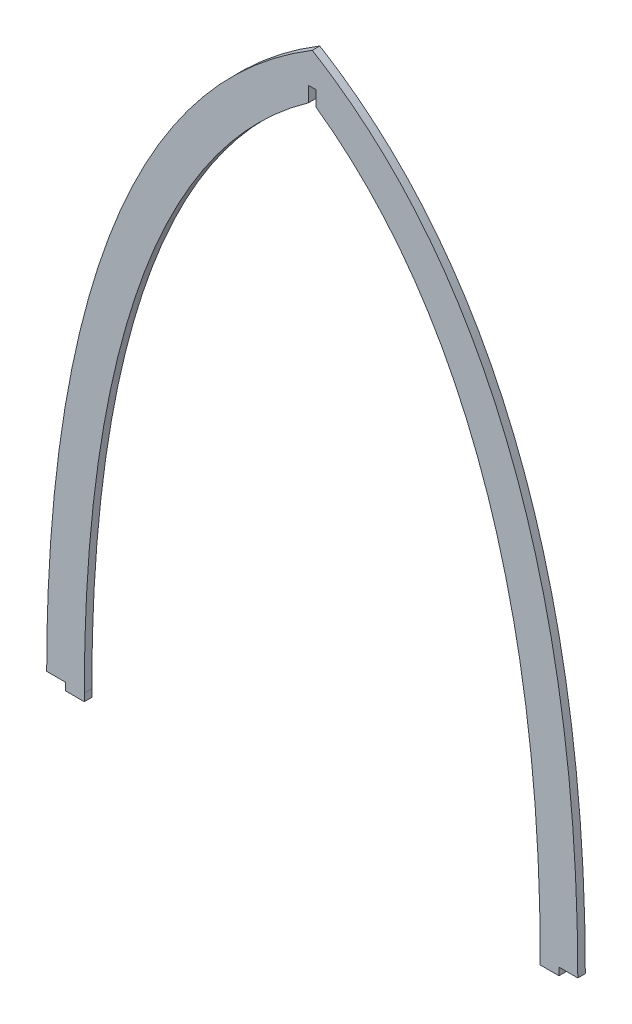
ISO-10303-21;
HEADER;
FILE_DESCRIPTION(('STEP AP214'),'2;1');
FILE_NAME('part.step','',(''),(''),'','','');
FILE_SCHEMA(('AUTOMOTIVE_DESIGN { 1 0 10303 214 1 1 1 1 }'));
ENDSEC;
DATA;
#1=APPLICATION_CONTEXT('core data for automotive mechanical design processes');
#2=APPLICATION_PROTOCOL_DEFINITION('international standard','automotive_design',2000,#1);
#3=PRODUCT_CONTEXT('',#1,'mechanical');
#4=PRODUCT('Part','Part','',(#3));
#5=PRODUCT_RELATED_PRODUCT_CATEGORY('part','',(#4));
#6=PRODUCT_DEFINITION_FORMATION('','',#4);
#7=PRODUCT_DEFINITION_CONTEXT('part definition',#1,'design');
#8=PRODUCT_DEFINITION('design','',#6,#7);
#9=PRODUCT_DEFINITION_SHAPE('','',#8);
#10=(LENGTH_UNIT() NAMED_UNIT(*) SI_UNIT(.MILLI.,.METRE.));
#11=(NAMED_UNIT(*) PLANE_ANGLE_UNIT() SI_UNIT($,.RADIAN.));
#12=(NAMED_UNIT(*) SI_UNIT($,.STERADIAN.) SOLID_ANGLE_UNIT());
#13=UNCERTAINTY_MEASURE_WITH_UNIT(LENGTH_MEASURE(1.E-05),#10,'distance_accuracy_value','');
#14=(GEOMETRIC_REPRESENTATION_CONTEXT(3) GLOBAL_UNCERTAINTY_ASSIGNED_CONTEXT((#13)) GLOBAL_UNIT_ASSIGNED_CONTEXT((#10,
#11,#12)) REPRESENTATION_CONTEXT('',''));
#15=CARTESIAN_POINT('',(0.,0.,0.));
#16=DIRECTION('',(0.,0.,1.));
#17=DIRECTION('',(1.,0.,0.));
#18=AXIS2_PLACEMENT_3D('',#15,#16,#17);
#19=CARTESIAN_POINT('',(105.999999999998,162.000000000004,1.5));
#20=CARTESIAN_POINT('',(105.999999999998,251.511239230205,1.5));
#21=CARTESIAN_POINT('',(88.9480866677907,376.101025723079,1.5));
#22=CARTESIAN_POINT('',(0.,429.683378346812,1.5));
#23=B_SPLINE_CURVE_WITH_KNOTS('',3,(#19,#20,#21,#22),.UNSPECIFIED.,.F.,.F.,(4,4),(0.,1.),.UNSPECIFIED.);
#24=DIRECTION('',(0.,0.,-1.));
#25=VECTOR('',#24,1.);
#26=SURFACE_OF_LINEAR_EXTRUSION('',#23,#25);
#27=CARTESIAN_POINT('',(105.999999999998,162.000000000004,-1.5));
#28=CARTESIAN_POINT('',(105.999999999998,251.511239230205,-1.5));
#29=CARTESIAN_POINT('',(88.9480866677907,376.101025723079,-1.5));
#30=CARTESIAN_POINT('',(0.,429.683378346812,-1.5));
#31=B_SPLINE_CURVE_WITH_KNOTS('',3,(#27,#28,#29,#30),.UNSPECIFIED.,.F.,.F.,(4,4),(0.,1.),.UNSPECIFIED.);
#32=CARTESIAN_POINT('',(105.999999999998,162.000000000004,-1.5));
#33=VERTEX_POINT('',#32);
#34=CARTESIAN_POINT('',(0.,429.683378346812,-1.5));
#35=VERTEX_POINT('',#34);
#36=EDGE_CURVE('E176',#33,#35,#31,.T.);
#37=ORIENTED_EDGE('',*,*,#36,.T.);
#38=DIRECTION('',(0.,0.,-1.));
#39=VECTOR('',#38,1.);
#40=CARTESIAN_POINT('',(0.,429.683378346812,1.5));
#41=LINE('',#40,#39);
#42=CARTESIAN_POINT('',(0.,429.683378346812,1.5));
#43=VERTEX_POINT('',#42);
#44=EDGE_CURVE('E11',#43,#35,#41,.T.);
#45=ORIENTED_EDGE('',*,*,#44,.F.);
#46=CARTESIAN_POINT('',(105.999999999998,162.000000000004,1.5));
#47=VERTEX_POINT('',#46);
#48=EDGE_CURVE('E224',#47,#43,#23,.T.);
#49=ORIENTED_EDGE('',*,*,#48,.F.);
#50=DIRECTION('',(0.,0.,-1.));
#51=VECTOR('',#50,1.);
#52=CARTESIAN_POINT('',(105.999999999998,162.000000000004,1.5));
#53=LINE('',#52,#51);
#54=EDGE_CURVE('E172',#47,#33,#53,.T.);
#55=ORIENTED_EDGE('',*,*,#54,.T.);
#56=EDGE_LOOP('',(#37,#45,#49,#55));
#57=FACE_BOUND('',#56,.T.);
#58=ADVANCED_FACE('F37',(#57),#26,.F.);
#59=CARTESIAN_POINT('',(0.,429.683378346812,1.5));
#60=CARTESIAN_POINT('',(-88.9480866677907,376.101025723079,1.5));
#61=CARTESIAN_POINT('',(-105.999999999998,251.511239230205,1.5));
#62=CARTESIAN_POINT('',(-105.999999999998,162.000000000004,1.5));
#63=B_SPLINE_CURVE_WITH_KNOTS('',3,(#59,#60,#61,#62),.UNSPECIFIED.,.F.,.F.,(4,4),(0.,1.),.UNSPECIFIED.);
#64=DIRECTION('',(0.,0.,-1.));
#65=VECTOR('',#64,1.);
#66=SURFACE_OF_LINEAR_EXTRUSION('',#63,#65);
#67=CARTESIAN_POINT('',(0.,429.683378346812,-1.5));
#68=CARTESIAN_POINT('',(-88.9480866677907,376.101025723079,-1.5));
#69=CARTESIAN_POINT('',(-105.999999999998,251.511239230205,-1.5));
#70=CARTESIAN_POINT('',(-105.999999999998,162.000000000004,-1.5));
#71=B_SPLINE_CURVE_WITH_KNOTS('',3,(#67,#68,#69,#70),.UNSPECIFIED.,.F.,.F.,(4,4),(0.,1.),.UNSPECIFIED.);
#72=CARTESIAN_POINT('',(-105.999999999998,162.000000000004,-1.5));
#73=VERTEX_POINT('',#72);
#74=EDGE_CURVE('E181',#35,#73,#71,.T.);
#75=ORIENTED_EDGE('',*,*,#74,.T.);
#76=DIRECTION('',(0.,0.,-1.));
#77=VECTOR('',#76,1.);
#78=CARTESIAN_POINT('',(-105.999999999998,162.000000000004,1.5));
#79=LINE('',#78,#77);
#80=CARTESIAN_POINT('',(-105.999999999998,162.000000000004,1.5));
#81=VERTEX_POINT('',#80);
#82=EDGE_CURVE('E46',#81,#73,#79,.T.);
#83=ORIENTED_EDGE('',*,*,#82,.F.);
#84=EDGE_CURVE('E118',#43,#81,#63,.T.);
#85=ORIENTED_EDGE('',*,*,#84,.F.);
#86=ORIENTED_EDGE('',*,*,#44,.T.);
#87=EDGE_LOOP('',(#75,#83,#85,#86));
#88=FACE_BOUND('',#87,.T.);
#89=ADVANCED_FACE('F311',(#88),#66,.F.);
#90=CARTESIAN_POINT('',(-105.999999999998,162.000000000004,1.5));
#91=DIRECTION('',(3.77475828372676E-13,1.,0.));
#92=DIRECTION('',(-1.,3.77475828372676E-13,0.));
#93=AXIS2_PLACEMENT_3D('',#90,#91,#92);
#94=PLANE('',#93);
#95=DIRECTION('',(1.,-3.77475828372676E-13,0.));
#96=VECTOR('',#95,1.);
#97=CARTESIAN_POINT('',(-105.999999999998,162.000000000004,-1.5));
#98=LINE('',#97,#96);
#99=CARTESIAN_POINT('',(-98.5000000000003,162.000000000001,-1.5));
#100=VERTEX_POINT('',#99);
#101=EDGE_CURVE('E188',#73,#100,#98,.T.);
#102=ORIENTED_EDGE('',*,*,#101,.T.);
#103=DIRECTION('',(0.,0.,-1.));
#104=VECTOR('',#103,1.);
#105=CARTESIAN_POINT('',(-98.5000000000003,162.000000000001,1.5));
#106=LINE('',#105,#104);
#107=CARTESIAN_POINT('',(-98.5000000000003,162.000000000001,1.5));
#108=VERTEX_POINT('',#107);
#109=EDGE_CURVE('E252',#108,#100,#106,.T.);
#110=ORIENTED_EDGE('',*,*,#109,.F.);
#111=DIRECTION('',(1.,-3.77475828372676E-13,0.));
#112=VECTOR('',#111,1.);
#113=CARTESIAN_POINT('',(-105.999999999998,162.000000000004,1.5));
#114=LINE('',#113,#112);
#115=EDGE_CURVE('E260',#81,#108,#114,.T.);
#116=ORIENTED_EDGE('',*,*,#115,.F.);
#117=ORIENTED_EDGE('',*,*,#82,.T.);
#118=EDGE_LOOP('',(#102,#110,#116,#117));
#119=FACE_BOUND('',#118,.T.);
#120=ADVANCED_FACE('F258',(#119),#94,.F.);
#121=CARTESIAN_POINT('',(-98.5000000000003,159.000000000001,1.5));
#122=DIRECTION('',(1.,0.,0.));
#123=DIRECTION('',(0.,0.,-1.));
#124=AXIS2_PLACEMENT_3D('',#121,#122,#123);
#125=PLANE('',#124);
#126=DIRECTION('',(0.,-1.,0.));
#127=VECTOR('',#126,1.);
#128=CARTESIAN_POINT('',(-98.5000000000003,159.000000000001,-1.5));
#129=LINE('',#128,#127);
#130=CARTESIAN_POINT('',(-98.5000000000003,159.000000000001,-1.5));
#131=VERTEX_POINT('',#130);
#132=EDGE_CURVE('E193',#100,#131,#129,.T.);
#133=ORIENTED_EDGE('',*,*,#132,.T.);
#134=DIRECTION('',(0.,0.,-1.));
#135=VECTOR('',#134,1.);
#136=CARTESIAN_POINT('',(-98.5000000000003,159.000000000001,1.5));
#137=LINE('',#136,#135);
#138=CARTESIAN_POINT('',(-98.5000000000003,159.000000000001,1.5));
#139=VERTEX_POINT('',#138);
#140=EDGE_CURVE('E249',#139,#131,#137,.T.);
#141=ORIENTED_EDGE('',*,*,#140,.F.);
#142=DIRECTION('',(0.,-1.,0.));
#143=VECTOR('',#142,1.);
#144=CARTESIAN_POINT('',(-98.5000000000003,159.000000000001,1.5));
#145=LINE('',#144,#143);
#146=EDGE_CURVE('E278',#108,#139,#145,.T.);
#147=ORIENTED_EDGE('',*,*,#146,.F.);
#148=ORIENTED_EDGE('',*,*,#109,.T.);
#149=EDGE_LOOP('',(#133,#141,#147,#148));
#150=FACE_BOUND('',#149,.T.);
#151=ADVANCED_FACE('F269',(#150),#125,.F.);
#152=CARTESIAN_POINT('',(-91.0000000000003,159.000000000001,1.5));
#153=DIRECTION('',(0.,1.,0.));
#154=DIRECTION('',(0.,0.,1.));
#155=AXIS2_PLACEMENT_3D('',#152,#153,#154);
#156=PLANE('',#155);
#157=DIRECTION('',(1.,0.,0.));
#158=VECTOR('',#157,1.);
#159=CARTESIAN_POINT('',(-91.0000000000003,159.000000000001,-1.5));
#160=LINE('',#159,#158);
#161=CARTESIAN_POINT('',(-91.0000000000003,159.000000000001,-1.5));
#162=VERTEX_POINT('',#161);
#163=EDGE_CURVE('E195',#131,#162,#160,.T.);
#164=ORIENTED_EDGE('',*,*,#163,.T.);
#165=DIRECTION('',(0.,0.,-1.));
#166=VECTOR('',#165,1.);
#167=CARTESIAN_POINT('',(-91.0000000000003,159.000000000001,1.5));
#168=LINE('',#167,#166);
#169=CARTESIAN_POINT('',(-91.0000000000003,159.000000000001,1.5));
#170=VERTEX_POINT('',#169);
#171=EDGE_CURVE('E246',#170,#162,#168,.T.);
#172=ORIENTED_EDGE('',*,*,#171,.F.);
#173=DIRECTION('',(1.,0.,0.));
#174=VECTOR('',#173,1.);
#175=CARTESIAN_POINT('',(-91.0000000000003,159.000000000001,1.5));
#176=LINE('',#175,#174);
#177=EDGE_CURVE('E275',#139,#170,#176,.T.);
#178=ORIENTED_EDGE('',*,*,#177,.F.);
#179=ORIENTED_EDGE('',*,*,#140,.T.);
#180=EDGE_LOOP('',(#164,#172,#178,#179));
#181=FACE_BOUND('',#180,.T.);
#182=ADVANCED_FACE('F273',(#181),#156,.F.);
#183=CARTESIAN_POINT('',(-90.9999999999979,162.000000000004,1.5));
#184=DIRECTION('',(-1.,8.0953762212173E-13,0.));
#185=DIRECTION('',(-8.0953762212173E-13,-1.,0.));
#186=AXIS2_PLACEMENT_3D('',#183,#184,#185);
#187=PLANE('',#186);
#188=DIRECTION('',(8.0953762212173E-13,1.,0.));
#189=VECTOR('',#188,1.);
#190=CARTESIAN_POINT('',(-90.9999999999979,162.000000000004,-1.5));
#191=LINE('',#190,#189);
#192=CARTESIAN_POINT('',(-90.9999999999979,162.000000000004,-1.5));
#193=VERTEX_POINT('',#192);
#194=EDGE_CURVE('E197',#162,#193,#191,.T.);
#195=ORIENTED_EDGE('',*,*,#194,.T.);
#196=DIRECTION('',(0.,0.,-1.));
#197=VECTOR('',#196,1.);
#198=CARTESIAN_POINT('',(-90.9999999999979,162.000000000004,1.5));
#199=LINE('',#198,#197);
#200=CARTESIAN_POINT('',(-90.9999999999979,162.000000000004,1.5));
#201=VERTEX_POINT('',#200);
#202=EDGE_CURVE('E243',#201,#193,#199,.T.);
#203=ORIENTED_EDGE('',*,*,#202,.F.);
#204=DIRECTION('',(8.0953762212173E-13,1.,0.));
#205=VECTOR('',#204,1.);
#206=CARTESIAN_POINT('',(-90.9999999999979,162.000000000004,1.5));
#207=LINE('',#206,#205);
#208=EDGE_CURVE('E277',#170,#201,#207,.T.);
#209=ORIENTED_EDGE('',*,*,#208,.F.);
#210=ORIENTED_EDGE('',*,*,#171,.T.);
#211=EDGE_LOOP('',(#195,#203,#209,#210));
#212=FACE_BOUND('',#211,.T.);
#213=ADVANCED_FACE('F300',(#212),#187,.F.);
#214=CARTESIAN_POINT('',(-90.9999999999979,162.000000000004,1.5));
#215=CARTESIAN_POINT('',(-91.0000003023244,163.331524351603,1.5));
#216=CARTESIAN_POINT('',(-90.9923772208511,165.983871564798,1.5));
#217=CARTESIAN_POINT('',(-90.9451731433241,171.374042760837,1.5));
#218=CARTESIAN_POINT('',(-90.8235078746332,178.205931855945,1.5));
#219=CARTESIAN_POINT('',(-90.5685215486452,186.555762495825,1.5));
#220=CARTESIAN_POINT('',(-90.0716530330046,197.860050944264,1.5));
#221=CARTESIAN_POINT('',(-89.1348004093346,212.269083652878,1.5));
#222=CARTESIAN_POINT('',(-87.4371070231186,229.8590328661,1.5));
#223=CARTESIAN_POINT('',(-85.0989947623211,247.601920352728,1.5));
#224=CARTESIAN_POINT('',(-81.0408896792529,271.267133734514,1.5));
#225=CARTESIAN_POINT('',(-74.0454955742705,300.495573647248,1.5));
#226=CARTESIAN_POINT('',(-62.1021844250291,333.833321675898,1.5));
#227=CARTESIAN_POINT('',(-48.8481628022896,359.221880846358,1.5));
#228=CARTESIAN_POINT('',(-36.0733572473476,377.590498753788,1.5));
#229=CARTESIAN_POINT('',(-25.355736840022,390.287263764066,1.5));
#230=CARTESIAN_POINT('',(-15.4180683562845,399.891345578018,1.5));
#231=CARTESIAN_POINT('',(-6.83792647578161,406.934515176343,1.5));
#232=CARTESIAN_POINT('',(-2.30437264100325,410.252851189701,1.5));
#233=CARTESIAN_POINT('',(-4.23001881166236E-05,411.841712632891,1.5));
#234=B_SPLINE_CURVE_WITH_KNOTS('',3,(#214,#215,#216,#217,#218,#219,#220,#221,#222,#223,#224,
#225,#226,#227,#228,#229,#230,#231,#232,#233),.UNSPECIFIED.,.F.,.F.,(4,1,1,1,1,1,1,1,1,1,1,1,1,
1,1,1,1,4),(0.,0.0151129692576097,0.0302259385152194,0.0604518770304388,0.0906778155456583,
0.120903754060878,0.181355631091317,0.241807508121755,0.302259385152194,0.362711262182633,
0.483615016243511,0.604518770304388,0.725422524365266,0.785874401395705,0.846326278426144,
0.906778155456583,0.937004093971802,0.967230032487022),.UNSPECIFIED.);
#235=DIRECTION('',(0.,0.,-1.));
#236=VECTOR('',#235,1.);
#237=SURFACE_OF_LINEAR_EXTRUSION('',#234,#236);
#238=CARTESIAN_POINT('',(-90.9999999999979,162.000000000004,-1.5));
#239=CARTESIAN_POINT('',(-91.0000003023244,163.331524351603,-1.5));
#240=CARTESIAN_POINT('',(-90.9923772208511,165.983871564798,-1.5));
#241=CARTESIAN_POINT('',(-90.9451731433241,171.374042760837,-1.5));
#242=CARTESIAN_POINT('',(-90.8235078746332,178.205931855945,-1.5));
#243=CARTESIAN_POINT('',(-90.5685215486452,186.555762495825,-1.5));
#244=CARTESIAN_POINT('',(-90.0716530330046,197.860050944264,-1.5));
#245=CARTESIAN_POINT('',(-89.1348004093346,212.269083652878,-1.5));
#246=CARTESIAN_POINT('',(-87.4371070231186,229.8590328661,-1.5));
#247=CARTESIAN_POINT('',(-85.0989947623211,247.601920352728,-1.5));
#248=CARTESIAN_POINT('',(-81.0408896792529,271.267133734514,-1.5));
#249=CARTESIAN_POINT('',(-74.0454955742705,300.495573647248,-1.5));
#250=CARTESIAN_POINT('',(-62.1021844250291,333.833321675898,-1.5));
#251=CARTESIAN_POINT('',(-48.8481628022896,359.221880846358,-1.5));
#252=CARTESIAN_POINT('',(-36.0733572473476,377.590498753788,-1.5));
#253=CARTESIAN_POINT('',(-25.355736840022,390.287263764066,-1.5));
#254=CARTESIAN_POINT('',(-15.4180683562845,399.891345578018,-1.5));
#255=CARTESIAN_POINT('',(-6.83792647578161,406.934515176343,-1.5));
#256=CARTESIAN_POINT('',(-2.30437264100325,410.252851189701,-1.5));
#257=CARTESIAN_POINT('',(-4.23001881166236E-05,411.841712632891,-1.5));
#258=B_SPLINE_CURVE_WITH_KNOTS('',3,(#238,#239,#240,#241,#242,#243,#244,#245,#246,#247,#248,
#249,#250,#251,#252,#253,#254,#255,#256,#257),.UNSPECIFIED.,.F.,.F.,(4,1,1,1,1,1,1,1,1,1,1,1,1,
1,1,1,1,4),(0.,0.0151129692576097,0.0302259385152194,0.0604518770304388,0.0906778155456583,
0.120903754060878,0.181355631091317,0.241807508121755,0.302259385152194,0.362711262182633,
0.483615016243511,0.604518770304388,0.725422524365266,0.785874401395705,0.846326278426144,
0.906778155456583,0.937004093971802,0.967230032487022),.UNSPECIFIED.);
#259=CARTESIAN_POINT('',(-1.50000000000011,410.793822053137,-1.5));
#260=VERTEX_POINT('',#259);
#261=EDGE_CURVE('E199',#193,#260,#258,.T.);
#262=ORIENTED_EDGE('',*,*,#261,.T.);
#263=DIRECTION('',(0.,0.,-1.));
#264=VECTOR('',#263,1.);
#265=CARTESIAN_POINT('',(-1.50000000000011,410.793822053137,1.5));
#266=LINE('',#265,#264);
#267=CARTESIAN_POINT('',(-1.50000000000011,410.793822053137,1.5));
#268=VERTEX_POINT('',#267);
#269=EDGE_CURVE('E240',#268,#260,#266,.T.);
#270=ORIENTED_EDGE('',*,*,#269,.F.);
#271=EDGE_CURVE('E280',#201,#268,#234,.T.);
#272=ORIENTED_EDGE('',*,*,#271,.F.);
#273=ORIENTED_EDGE('',*,*,#202,.T.);
#274=EDGE_LOOP('',(#262,#270,#272,#273));
#275=FACE_BOUND('',#274,.T.);
#276=ADVANCED_FACE('F295',(#275),#237,.F.);
#277=CARTESIAN_POINT('',(-1.50000000000011,410.793822053137,1.5));
#278=DIRECTION('',(-1.,0.,0.));
#279=DIRECTION('',(0.,-1.,0.));
#280=AXIS2_PLACEMENT_3D('',#277,#278,#279);
#281=PLANE('',#280);
#282=DIRECTION('',(0.,1.,0.));
#283=VECTOR('',#282,1.);
#284=CARTESIAN_POINT('',(-1.50000000000011,410.793822053137,-1.5));
#285=LINE('',#284,#283);
#286=CARTESIAN_POINT('',(-1.50000000000013,416.841652361276,-1.5));
#287=VERTEX_POINT('',#286);
#288=EDGE_CURVE('E203',#260,#287,#285,.T.);
#289=ORIENTED_EDGE('',*,*,#288,.T.);
#290=DIRECTION('',(0.,0.,-1.));
#291=VECTOR('',#290,1.);
#292=CARTESIAN_POINT('',(-1.50000000000013,416.841652361276,1.5));
#293=LINE('',#292,#291);
#294=CARTESIAN_POINT('',(-1.50000000000013,416.841652361276,1.5));
#295=VERTEX_POINT('',#294);
#296=EDGE_CURVE('E237',#295,#287,#293,.T.);
#297=ORIENTED_EDGE('',*,*,#296,.F.);
#298=DIRECTION('',(0.,1.,0.));
#299=VECTOR('',#298,1.);
#300=CARTESIAN_POINT('',(-1.50000000000011,410.793822053137,1.5));
#301=LINE('',#300,#299);
#302=EDGE_CURVE('E289',#268,#295,#301,.T.);
#303=ORIENTED_EDGE('',*,*,#302,.F.);
#304=ORIENTED_EDGE('',*,*,#269,.T.);
#305=EDGE_LOOP('',(#289,#297,#303,#304));
#306=FACE_BOUND('',#305,.T.);
#307=ADVANCED_FACE('F299',(#306),#281,.F.);
#308=CARTESIAN_POINT('',(-1.50000000000013,416.841652361276,1.5));
#309=DIRECTION('',(0.,1.,0.));
#310=DIRECTION('',(-1.,0.,0.));
#311=AXIS2_PLACEMENT_3D('',#308,#309,#310);
#312=PLANE('',#311);
#313=DIRECTION('',(1.,0.,0.));
#314=VECTOR('',#313,1.);
#315=CARTESIAN_POINT('',(-1.50000000000013,416.841652361276,-1.5));
#316=LINE('',#315,#314);
#317=CARTESIAN_POINT('',(1.49999999999987,416.841652361276,-1.5));
#318=VERTEX_POINT('',#317);
#319=EDGE_CURVE('E208',#287,#318,#316,.T.);
#320=ORIENTED_EDGE('',*,*,#319,.T.);
#321=DIRECTION('',(0.,0.,-1.));
#322=VECTOR('',#321,1.);
#323=CARTESIAN_POINT('',(1.49999999999987,416.841652361276,1.5));
#324=LINE('',#323,#322);
#325=CARTESIAN_POINT('',(1.49999999999987,416.841652361276,1.5));
#326=VERTEX_POINT('',#325);
#327=EDGE_CURVE('E234',#326,#318,#324,.T.);
#328=ORIENTED_EDGE('',*,*,#327,.F.);
#329=DIRECTION('',(1.,0.,0.));
#330=VECTOR('',#329,1.);
#331=CARTESIAN_POINT('',(-1.50000000000013,416.841652361276,1.5));
#332=LINE('',#331,#330);
#333=EDGE_CURVE('E349',#295,#326,#332,.T.);
#334=ORIENTED_EDGE('',*,*,#333,.F.);
#335=ORIENTED_EDGE('',*,*,#296,.T.);
#336=EDGE_LOOP('',(#320,#328,#334,#335));
#337=FACE_BOUND('',#336,.T.);
#338=ADVANCED_FACE('F346',(#337),#312,.F.);
#339=CARTESIAN_POINT('',(1.49999999999987,416.841652361276,1.5));
#340=DIRECTION('',(1.,-1.59909965819582E-13,0.));
#341=DIRECTION('',(1.59909965819582E-13,1.,0.));
#342=AXIS2_PLACEMENT_3D('',#339,#340,#341);
#343=PLANE('',#342);
#344=DIRECTION('',(-1.59909965819582E-13,-1.,0.));
#345=VECTOR('',#344,1.);
#346=CARTESIAN_POINT('',(1.49999999999987,416.841652361276,-1.5));
#347=LINE('',#346,#345);
#348=CARTESIAN_POINT('',(1.49999999999895,410.793822053138,-1.5));
#349=VERTEX_POINT('',#348);
#350=EDGE_CURVE('E210',#318,#349,#347,.T.);
#351=ORIENTED_EDGE('',*,*,#350,.T.);
#352=DIRECTION('',(0.,0.,-1.));
#353=VECTOR('',#352,1.);
#354=CARTESIAN_POINT('',(1.49999999999895,410.793822053138,1.5));
#355=LINE('',#354,#353);
#356=CARTESIAN_POINT('',(1.49999999999895,410.793822053138,1.5));
#357=VERTEX_POINT('',#356);
#358=EDGE_CURVE('E231',#357,#349,#355,.T.);
#359=ORIENTED_EDGE('',*,*,#358,.F.);
#360=DIRECTION('',(-1.59909965819582E-13,-1.,0.));
#361=VECTOR('',#360,1.);
#362=CARTESIAN_POINT('',(1.49999999999987,416.841652361276,1.5));
#363=LINE('',#362,#361);
#364=EDGE_CURVE('E340',#326,#357,#363,.T.);
#365=ORIENTED_EDGE('',*,*,#364,.F.);
#366=ORIENTED_EDGE('',*,*,#327,.T.);
#367=EDGE_LOOP('',(#351,#359,#365,#366));
#368=FACE_BOUND('',#367,.T.);
#369=ADVANCED_FACE('F339',(#368),#343,.F.);
#370=CARTESIAN_POINT('',(4.23002207411026E-05,411.841712632868,1.5));
#371=CARTESIAN_POINT('',(2.30437264103542,410.252851189678,1.5));
#372=CARTESIAN_POINT('',(6.83792647581292,406.93451517632,1.5));
#373=CARTESIAN_POINT('',(15.4180683563142,399.891345577995,1.5));
#374=CARTESIAN_POINT('',(25.3557368400496,390.287263764044,1.5));
#375=CARTESIAN_POINT('',(36.0733572473729,377.590498753766,1.5));
#376=CARTESIAN_POINT('',(48.8481628023117,359.221880846338,1.5));
#377=CARTESIAN_POINT('',(62.1021844250474,333.833321675879,1.5));
#378=CARTESIAN_POINT('',(74.0454955742846,300.495573647233,1.5));
#379=CARTESIAN_POINT('',(81.0408896792635,271.267133734502,1.5));
#380=CARTESIAN_POINT('',(85.0989947623292,247.601920352719,1.5));
#381=CARTESIAN_POINT('',(87.4371070231248,229.859032866092,1.5));
#382=CARTESIAN_POINT('',(89.1348004093392,212.269083652873,1.5));
#383=CARTESIAN_POINT('',(90.0716530330079,197.86005094426,1.5));
#384=CARTESIAN_POINT('',(90.5685215486474,186.555762495822,1.5));
#385=CARTESIAN_POINT('',(90.8235078746347,178.205931855944,1.5));
#386=CARTESIAN_POINT('',(90.9451731433249,171.374042760836,1.5));
#387=CARTESIAN_POINT('',(90.9923772208515,165.983871564798,1.5));
#388=CARTESIAN_POINT('',(91.0000003023246,163.331524351603,1.5));
#389=CARTESIAN_POINT('',(90.999999999998,162.000000000004,1.5));
#390=B_SPLINE_CURVE_WITH_KNOTS('',3,(#370,#371,#372,#373,#374,#375,#376,#377,#378,#379,#380,
#381,#382,#383,#384,#385,#386,#387,#388,#389),.UNSPECIFIED.,.F.,.F.,(4,1,1,1,1,1,1,1,1,1,1,1,1,
1,1,1,1,4),(0.,0.0302259385152195,0.0604518770304389,0.120903754060878,0.181355631091316,
0.241807508121755,0.362711262182633,0.483615016243511,0.604518770304388,0.664970647334827,
0.725422524365266,0.785874401395705,0.846326278426144,0.876552216941363,0.906778155456582,
0.937004093971802,0.952117063229412,0.967230032487021),.UNSPECIFIED.);
#391=DIRECTION('',(0.,0.,-1.));
#392=VECTOR('',#391,1.);
#393=SURFACE_OF_LINEAR_EXTRUSION('',#390,#392);
#394=CARTESIAN_POINT('',(4.23002207411026E-05,411.841712632868,-1.5));
#395=CARTESIAN_POINT('',(2.30437264103542,410.252851189678,-1.5));
#396=CARTESIAN_POINT('',(6.83792647581292,406.93451517632,-1.5));
#397=CARTESIAN_POINT('',(15.4180683563142,399.891345577995,-1.5));
#398=CARTESIAN_POINT('',(25.3557368400496,390.287263764044,-1.5));
#399=CARTESIAN_POINT('',(36.0733572473729,377.590498753766,-1.5));
#400=CARTESIAN_POINT('',(48.8481628023117,359.221880846338,-1.5));
#401=CARTESIAN_POINT('',(62.1021844250474,333.833321675879,-1.5));
#402=CARTESIAN_POINT('',(74.0454955742846,300.495573647233,-1.5));
#403=CARTESIAN_POINT('',(81.0408896792635,271.267133734502,-1.5));
#404=CARTESIAN_POINT('',(85.0989947623292,247.601920352719,-1.5));
#405=CARTESIAN_POINT('',(87.4371070231248,229.859032866092,-1.5));
#406=CARTESIAN_POINT('',(89.1348004093392,212.269083652873,-1.5));
#407=CARTESIAN_POINT('',(90.0716530330079,197.86005094426,-1.5));
#408=CARTESIAN_POINT('',(90.5685215486474,186.555762495822,-1.5));
#409=CARTESIAN_POINT('',(90.8235078746347,178.205931855944,-1.5));
#410=CARTESIAN_POINT('',(90.9451731433249,171.374042760836,-1.5));
#411=CARTESIAN_POINT('',(90.9923772208515,165.983871564798,-1.5));
#412=CARTESIAN_POINT('',(91.0000003023246,163.331524351603,-1.5));
#413=CARTESIAN_POINT('',(90.999999999998,162.000000000004,-1.5));
#414=B_SPLINE_CURVE_WITH_KNOTS('',3,(#394,#395,#396,#397,#398,#399,#400,#401,#402,#403,#404,
#405,#406,#407,#408,#409,#410,#411,#412,#413),.UNSPECIFIED.,.F.,.F.,(4,1,1,1,1,1,1,1,1,1,1,1,1,
1,1,1,1,4),(0.,0.0302259385152195,0.0604518770304389,0.120903754060878,0.181355631091316,
0.241807508121755,0.362711262182633,0.483615016243511,0.604518770304388,0.664970647334827,
0.725422524365266,0.785874401395705,0.846326278426144,0.876552216941363,0.906778155456582,
0.937004093971802,0.952117063229412,0.967230032487021),.UNSPECIFIED.);
#415=CARTESIAN_POINT('',(90.9999999999979,162.000000000004,-1.5));
#416=VERTEX_POINT('',#415);
#417=EDGE_CURVE('E212',#349,#416,#414,.T.);
#418=ORIENTED_EDGE('',*,*,#417,.T.);
#419=DIRECTION('',(0.,0.,-1.));
#420=VECTOR('',#419,1.);
#421=CARTESIAN_POINT('',(90.9999999999979,162.000000000004,1.5));
#422=LINE('',#421,#420);
#423=CARTESIAN_POINT('',(90.9999999999979,162.000000000004,1.5));
#424=VERTEX_POINT('',#423);
#425=EDGE_CURVE('E228',#424,#416,#422,.T.);
#426=ORIENTED_EDGE('',*,*,#425,.F.);
#427=EDGE_CURVE('E335',#357,#424,#390,.T.);
#428=ORIENTED_EDGE('',*,*,#427,.F.);
#429=ORIENTED_EDGE('',*,*,#358,.T.);
#430=EDGE_LOOP('',(#418,#426,#428,#429));
#431=FACE_BOUND('',#430,.T.);
#432=ADVANCED_FACE('F334',(#431),#393,.F.);
#433=CARTESIAN_POINT('',(90.9999999999979,162.000000000004,1.5));
#434=DIRECTION('',(1.,8.09537622121723E-13,0.));
#435=DIRECTION('',(-8.09537622121723E-13,1.,0.));
#436=AXIS2_PLACEMENT_3D('',#433,#434,#435);
#437=PLANE('',#436);
#438=DIRECTION('',(8.09537622121723E-13,-1.,0.));
#439=VECTOR('',#438,1.);
#440=CARTESIAN_POINT('',(90.9999999999979,162.000000000004,-1.5));
#441=LINE('',#440,#439);
#442=CARTESIAN_POINT('',(91.0000000000004,159.000000000001,-1.5));
#443=VERTEX_POINT('',#442);
#444=EDGE_CURVE('E216',#416,#443,#441,.T.);
#445=ORIENTED_EDGE('',*,*,#444,.T.);
#446=DIRECTION('',(0.,0.,-1.));
#447=VECTOR('',#446,1.);
#448=CARTESIAN_POINT('',(91.0000000000004,159.000000000001,1.5));
#449=LINE('',#448,#447);
#450=CARTESIAN_POINT('',(91.0000000000004,159.000000000001,1.5));
#451=VERTEX_POINT('',#450);
#452=EDGE_CURVE('E167',#451,#443,#449,.T.);
#453=ORIENTED_EDGE('',*,*,#452,.F.);
#454=DIRECTION('',(8.09537622121723E-13,-1.,0.));
#455=VECTOR('',#454,1.);
#456=CARTESIAN_POINT('',(90.9999999999979,162.000000000004,1.5));
#457=LINE('',#456,#455);
#458=EDGE_CURVE('E158',#424,#451,#457,.T.);
#459=ORIENTED_EDGE('',*,*,#458,.F.);
#460=ORIENTED_EDGE('',*,*,#425,.T.);
#461=EDGE_LOOP('',(#445,#453,#459,#460));
#462=FACE_BOUND('',#461,.T.);
#463=ADVANCED_FACE('F330',(#462),#437,.F.);
#464=CARTESIAN_POINT('',(91.0000000000004,159.000000000001,1.5));
#465=DIRECTION('',(0.,1.,0.));
#466=DIRECTION('',(0.,0.,1.));
#467=AXIS2_PLACEMENT_3D('',#464,#465,#466);
#468=PLANE('',#467);
#469=DIRECTION('',(1.,0.,0.));
#470=VECTOR('',#469,1.);
#471=CARTESIAN_POINT('',(91.0000000000004,159.000000000001,-1.5));
#472=LINE('',#471,#470);
#473=CARTESIAN_POINT('',(98.5000000000004,159.000000000001,-1.5));
#474=VERTEX_POINT('',#473);
#475=EDGE_CURVE('E166',#443,#474,#472,.T.);
#476=ORIENTED_EDGE('',*,*,#475,.T.);
#477=DIRECTION('',(0.,0.,-1.));
#478=VECTOR('',#477,1.);
#479=CARTESIAN_POINT('',(98.5000000000004,159.000000000001,1.5));
#480=LINE('',#479,#478);
#481=CARTESIAN_POINT('',(98.5000000000004,159.000000000001,1.5));
#482=VERTEX_POINT('',#481);
#483=EDGE_CURVE('E163',#482,#474,#480,.T.);
#484=ORIENTED_EDGE('',*,*,#483,.F.);
#485=DIRECTION('',(1.,0.,0.));
#486=VECTOR('',#485,1.);
#487=CARTESIAN_POINT('',(91.0000000000004,159.000000000001,1.5));
#488=LINE('',#487,#486);
#489=EDGE_CURVE('E152',#451,#482,#488,.T.);
#490=ORIENTED_EDGE('',*,*,#489,.F.);
#491=ORIENTED_EDGE('',*,*,#452,.T.);
#492=EDGE_LOOP('',(#476,#484,#490,#491));
#493=FACE_BOUND('',#492,.T.);
#494=ADVANCED_FACE('F164',(#493),#468,.F.);
#495=CARTESIAN_POINT('',(98.5000000000004,159.000000000001,1.5));
#496=DIRECTION('',(-1.,0.,0.));
#497=DIRECTION('',(0.,0.,1.));
#498=AXIS2_PLACEMENT_3D('',#495,#496,#497);
#499=PLANE('',#498);
#500=DIRECTION('',(0.,1.,0.));
#501=VECTOR('',#500,1.);
#502=CARTESIAN_POINT('',(98.5000000000004,159.000000000001,-1.5));
#503=LINE('',#502,#501);
#504=CARTESIAN_POINT('',(98.5000000000004,162.000000000001,-1.5));
#505=VERTEX_POINT('',#504);
#506=EDGE_CURVE('E104',#474,#505,#503,.T.);
#507=ORIENTED_EDGE('',*,*,#506,.T.);
#508=DIRECTION('',(0.,0.,-1.));
#509=VECTOR('',#508,1.);
#510=CARTESIAN_POINT('',(98.5000000000004,162.000000000001,1.5));
#511=LINE('',#510,#509);
#512=CARTESIAN_POINT('',(98.5000000000004,162.000000000001,1.5));
#513=VERTEX_POINT('',#512);
#514=EDGE_CURVE('E168',#513,#505,#511,.T.);
#515=ORIENTED_EDGE('',*,*,#514,.F.);
#516=DIRECTION('',(0.,1.,0.));
#517=VECTOR('',#516,1.);
#518=CARTESIAN_POINT('',(98.5000000000004,159.000000000001,1.5));
#519=LINE('',#518,#517);
#520=EDGE_CURVE('E156',#482,#513,#519,.T.);
#521=ORIENTED_EDGE('',*,*,#520,.F.);
#522=ORIENTED_EDGE('',*,*,#483,.T.);
#523=EDGE_LOOP('',(#507,#515,#521,#522));
#524=FACE_BOUND('',#523,.T.);
#525=ADVANCED_FACE('F170',(#524),#499,.F.);
#526=CARTESIAN_POINT('',(98.5000000000004,162.000000000001,1.5));
#527=DIRECTION('',(-3.77475828372676E-13,1.,0.));
#528=DIRECTION('',(-1.,-3.77475828372676E-13,0.));
#529=AXIS2_PLACEMENT_3D('',#526,#527,#528);
#530=PLANE('',#529);
#531=DIRECTION('',(1.,3.77475828372676E-13,0.));
#532=VECTOR('',#531,1.);
#533=CARTESIAN_POINT('',(98.5000000000004,162.000000000001,-1.5));
#534=LINE('',#533,#532);
#535=EDGE_CURVE('E110',#505,#33,#534,.T.);
#536=ORIENTED_EDGE('',*,*,#535,.T.);
#537=ORIENTED_EDGE('',*,*,#54,.F.);
#538=DIRECTION('',(1.,3.77475828372676E-13,0.));
#539=VECTOR('',#538,1.);
#540=CARTESIAN_POINT('',(98.5000000000004,162.000000000001,1.5));
#541=LINE('',#540,#539);
#542=EDGE_CURVE('E54',#513,#47,#541,.T.);
#543=ORIENTED_EDGE('',*,*,#542,.F.);
#544=ORIENTED_EDGE('',*,*,#514,.T.);
#545=EDGE_LOOP('',(#536,#537,#543,#544));
#546=FACE_BOUND('',#545,.T.);
#547=ADVANCED_FACE('F444',(#546),#530,.F.);
#548=CARTESIAN_POINT('',(86.3555325004205,309.315021650833,1.5));
#549=DIRECTION('',(0.,0.,-1.));
#550=DIRECTION('',(-1.,0.,0.));
#551=AXIS2_PLACEMENT_3D('',#548,#549,#550);
#552=PLANE('',#551);
#553=ORIENTED_EDGE('',*,*,#48,.T.);
#554=ORIENTED_EDGE('',*,*,#84,.T.);
#555=ORIENTED_EDGE('',*,*,#115,.T.);
#556=ORIENTED_EDGE('',*,*,#146,.T.);
#557=ORIENTED_EDGE('',*,*,#177,.T.);
#558=ORIENTED_EDGE('',*,*,#208,.T.);
#559=ORIENTED_EDGE('',*,*,#271,.T.);
#560=ORIENTED_EDGE('',*,*,#302,.T.);
#561=ORIENTED_EDGE('',*,*,#333,.T.);
#562=ORIENTED_EDGE('',*,*,#364,.T.);
#563=ORIENTED_EDGE('',*,*,#427,.T.);
#564=ORIENTED_EDGE('',*,*,#458,.T.);
#565=ORIENTED_EDGE('',*,*,#489,.T.);
#566=ORIENTED_EDGE('',*,*,#520,.T.);
#567=ORIENTED_EDGE('',*,*,#542,.T.);
#568=EDGE_LOOP('',(#553,#554,#555,#556,#557,#558,#559,#560,#561,#562,#563,#564,#565,#566,#567));
#569=FACE_BOUND('',#568,.T.);
#570=ADVANCED_FACE('F154',(#569),#552,.F.);
#571=CARTESIAN_POINT('',(86.3555325004205,309.315021650833,-1.5));
#572=DIRECTION('',(0.,0.,-1.));
#573=DIRECTION('',(-1.,0.,0.));
#574=AXIS2_PLACEMENT_3D('',#571,#572,#573);
#575=PLANE('',#574);
#576=ORIENTED_EDGE('',*,*,#36,.F.);
#577=ORIENTED_EDGE('',*,*,#535,.F.);
#578=ORIENTED_EDGE('',*,*,#506,.F.);
#579=ORIENTED_EDGE('',*,*,#475,.F.);
#580=ORIENTED_EDGE('',*,*,#444,.F.);
#581=ORIENTED_EDGE('',*,*,#417,.F.);
#582=ORIENTED_EDGE('',*,*,#350,.F.);
#583=ORIENTED_EDGE('',*,*,#319,.F.);
#584=ORIENTED_EDGE('',*,*,#288,.F.);
#585=ORIENTED_EDGE('',*,*,#261,.F.);
#586=ORIENTED_EDGE('',*,*,#194,.F.);
#587=ORIENTED_EDGE('',*,*,#163,.F.);
#588=ORIENTED_EDGE('',*,*,#132,.F.);
#589=ORIENTED_EDGE('',*,*,#101,.F.);
#590=ORIENTED_EDGE('',*,*,#74,.F.);
#591=EDGE_LOOP('',(#576,#577,#578,#579,#580,#581,#582,#583,#584,#585,#586,#587,#588,#589,#590));
#592=FACE_BOUND('',#591,.T.);
#593=ADVANCED_FACE('F264',(#592),#575,.T.);
#594=CLOSED_SHELL('',(#58,#89,#120,#151,#182,#213,#276,#307,#338,#369,#432,#463,#494,#525,#547,
#570,#593));
#595=MANIFOLD_SOLID_BREP('B2',#594);
#596=ADVANCED_BREP_SHAPE_REPRESENTATION('',(#18,#595),#14);
#597=SHAPE_DEFINITION_REPRESENTATION(#9,#596);
ENDSEC;
END-ISO-10303-21;
